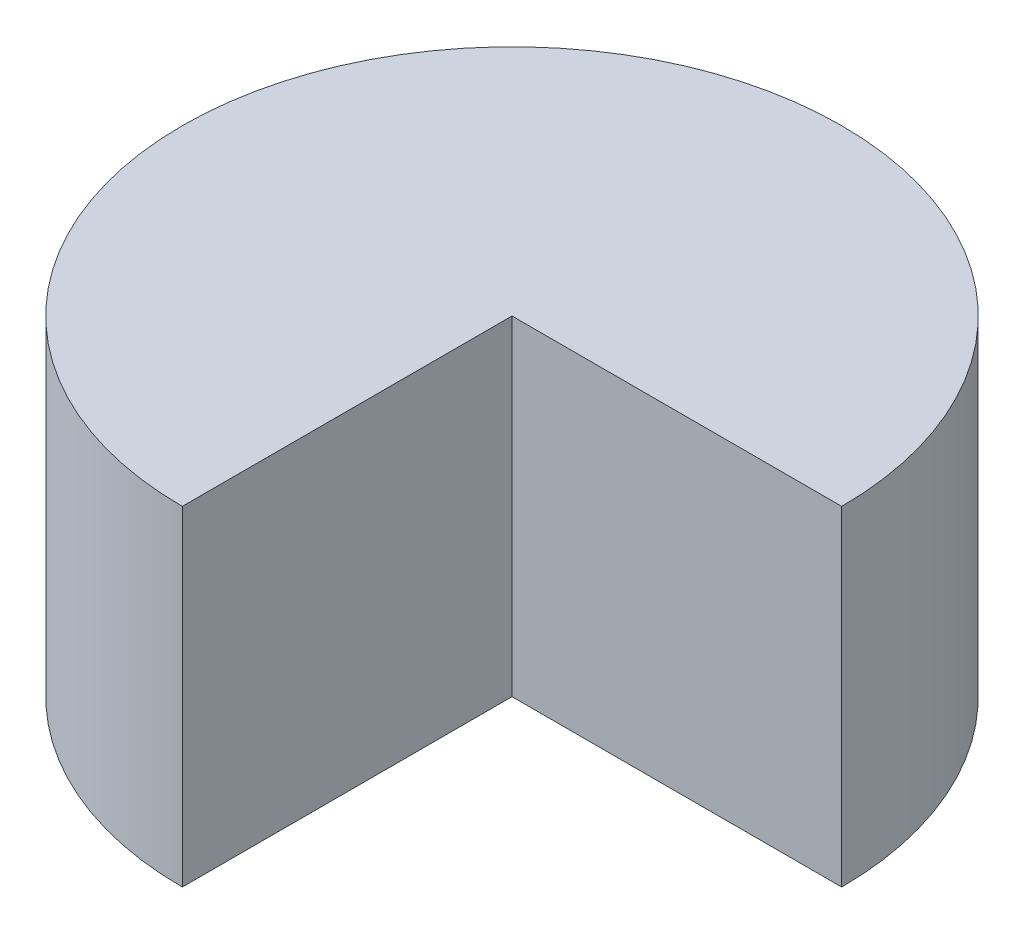
ISO-10303-21;
HEADER;
FILE_DESCRIPTION(('STEP AP214'),'2;1');
FILE_NAME('part.step','',(''),(''),'','','');
FILE_SCHEMA(('AUTOMOTIVE_DESIGN { 1 0 10303 214 1 1 1 1 }'));
ENDSEC;
DATA;
#1=APPLICATION_CONTEXT('core data for automotive mechanical design processes');
#2=APPLICATION_PROTOCOL_DEFINITION('international standard','automotive_design',2000,#1);
#3=PRODUCT_CONTEXT('',#1,'mechanical');
#4=PRODUCT('Part','Part','',(#3));
#5=PRODUCT_RELATED_PRODUCT_CATEGORY('part','',(#4));
#6=PRODUCT_DEFINITION_FORMATION('','',#4);
#7=PRODUCT_DEFINITION_CONTEXT('part definition',#1,'design');
#8=PRODUCT_DEFINITION('design','',#6,#7);
#9=PRODUCT_DEFINITION_SHAPE('','',#8);
#10=(LENGTH_UNIT() NAMED_UNIT(*) SI_UNIT(.MILLI.,.METRE.));
#11=(NAMED_UNIT(*) PLANE_ANGLE_UNIT() SI_UNIT($,.RADIAN.));
#12=(NAMED_UNIT(*) SI_UNIT($,.STERADIAN.) SOLID_ANGLE_UNIT());
#13=UNCERTAINTY_MEASURE_WITH_UNIT(LENGTH_MEASURE(1.E-05),#10,'distance_accuracy_value','');
#14=(GEOMETRIC_REPRESENTATION_CONTEXT(3) GLOBAL_UNCERTAINTY_ASSIGNED_CONTEXT((#13)) GLOBAL_UNIT_ASSIGNED_CONTEXT((#10,
#11,#12)) REPRESENTATION_CONTEXT('',''));
#15=CARTESIAN_POINT('',(0.,0.,0.));
#16=DIRECTION('',(0.,0.,1.));
#17=DIRECTION('',(1.,0.,0.));
#18=AXIS2_PLACEMENT_3D('',#15,#16,#17);
#19=CARTESIAN_POINT('',(0.,0.,0.));
#20=DIRECTION('',(0.,-1.,0.));
#21=DIRECTION('',(0.,0.,-1.));
#22=AXIS2_PLACEMENT_3D('',#19,#20,#21);
#23=PLANE('',#22);
#24=DIRECTION('',(0.,0.,-1.));
#25=VECTOR('',#24,1.);
#26=CARTESIAN_POINT('',(0.,0.,80.));
#27=LINE('',#26,#25);
#28=CARTESIAN_POINT('',(0.,0.,80.));
#29=VERTEX_POINT('',#28);
#30=CARTESIAN_POINT('',(0.,0.,0.));
#31=VERTEX_POINT('',#30);
#32=EDGE_CURVE('E126',#29,#31,#27,.T.);
#33=ORIENTED_EDGE('',*,*,#32,.F.);
#34=CARTESIAN_POINT('',(0.,0.,0.));
#35=DIRECTION('',(0.,1.,0.));
#36=DIRECTION('',(0.,0.,-1.));
#37=AXIS2_PLACEMENT_3D('',#34,#35,#36);
#38=CIRCLE('',#37,80.);
#39=CARTESIAN_POINT('',(80.,0.,0.));
#40=VERTEX_POINT('',#39);
#41=EDGE_CURVE('E81',#40,#29,#38,.T.);
#42=ORIENTED_EDGE('',*,*,#41,.F.);
#43=DIRECTION('',(1.,0.,0.));
#44=VECTOR('',#43,1.);
#45=CARTESIAN_POINT('',(0.,0.,0.));
#46=LINE('',#45,#44);
#47=EDGE_CURVE('E132',#31,#40,#46,.T.);
#48=ORIENTED_EDGE('',*,*,#47,.F.);
#49=EDGE_LOOP('',(#33,#42,#48));
#50=FACE_BOUND('',#49,.T.);
#51=CARTESIAN_POINT('',(0.,0.,0.));
#52=DIRECTION('',(0.,-1.,0.));
#53=DIRECTION('',(0.,0.,-1.));
#54=AXIS2_PLACEMENT_3D('',#51,#52,#53);
#55=CIRCLE('',#54,75.);
#56=CARTESIAN_POINT('',(74.8331477354788,0.,-5.));
#57=VERTEX_POINT('',#56);
#58=CARTESIAN_POINT('',(-5.,0.,74.8331477354788));
#59=VERTEX_POINT('',#58);
#60=EDGE_CURVE('E55',#57,#59,#55,.F.);
#61=ORIENTED_EDGE('',*,*,#60,.T.);
#62=DIRECTION('',(0.,0.,-1.));
#63=VECTOR('',#62,1.);
#64=CARTESIAN_POINT('',(-5.,0.,0.));
#65=LINE('',#64,#63);
#66=CARTESIAN_POINT('',(-5.,0.,-5.));
#67=VERTEX_POINT('',#66);
#68=EDGE_CURVE('E140',#59,#67,#65,.T.);
#69=ORIENTED_EDGE('',*,*,#68,.T.);
#70=DIRECTION('',(1.,0.,0.));
#71=VECTOR('',#70,1.);
#72=CARTESIAN_POINT('',(0.,0.,-5.));
#73=LINE('',#72,#71);
#74=EDGE_CURVE('E124',#67,#57,#73,.T.);
#75=ORIENTED_EDGE('',*,*,#74,.T.);
#76=EDGE_LOOP('',(#61,#69,#75));
#77=FACE_BOUND('',#76,.T.);
#78=ADVANCED_FACE('F39',(#50,#77),#23,.T.);
#79=CARTESIAN_POINT('',(0.,80.,80.));
#80=DIRECTION('',(-1.,0.,0.));
#81=DIRECTION('',(0.,0.,1.));
#82=AXIS2_PLACEMENT_3D('',#79,#80,#81);
#83=PLANE('',#82);
#84=ORIENTED_EDGE('',*,*,#32,.T.);
#85=DIRECTION('',(0.,-1.,0.));
#86=VECTOR('',#85,1.);
#87=CARTESIAN_POINT('',(0.,80.,0.));
#88=LINE('',#87,#86);
#89=CARTESIAN_POINT('',(0.,80.,0.));
#90=VERTEX_POINT('',#89);
#91=EDGE_CURVE('E11',#90,#31,#88,.T.);
#92=ORIENTED_EDGE('',*,*,#91,.F.);
#93=DIRECTION('',(0.,0.,-1.));
#94=VECTOR('',#93,1.);
#95=CARTESIAN_POINT('',(0.,80.,80.));
#96=LINE('',#95,#94);
#97=CARTESIAN_POINT('',(0.,80.,80.));
#98=VERTEX_POINT('',#97);
#99=EDGE_CURVE('E147',#98,#90,#96,.T.);
#100=ORIENTED_EDGE('',*,*,#99,.F.);
#101=DIRECTION('',(0.,-1.,0.));
#102=VECTOR('',#101,1.);
#103=CARTESIAN_POINT('',(0.,80.,80.));
#104=LINE('',#103,#102);
#105=EDGE_CURVE('E153',#98,#29,#104,.T.);
#106=ORIENTED_EDGE('',*,*,#105,.T.);
#107=EDGE_LOOP('',(#84,#92,#100,#106));
#108=FACE_BOUND('',#107,.T.);
#109=ADVANCED_FACE('F41',(#108),#83,.F.);
#110=CARTESIAN_POINT('',(0.,80.,0.));
#111=DIRECTION('',(0.,0.,-1.));
#112=DIRECTION('',(-1.,0.,0.));
#113=AXIS2_PLACEMENT_3D('',#110,#111,#112);
#114=PLANE('',#113);
#115=ORIENTED_EDGE('',*,*,#47,.T.);
#116=DIRECTION('',(0.,-1.,0.));
#117=VECTOR('',#116,1.);
#118=CARTESIAN_POINT('',(80.,80.,0.));
#119=LINE('',#118,#117);
#120=CARTESIAN_POINT('',(80.,80.,0.));
#121=VERTEX_POINT('',#120);
#122=EDGE_CURVE('E48',#121,#40,#119,.T.);
#123=ORIENTED_EDGE('',*,*,#122,.F.);
#124=DIRECTION('',(1.,0.,0.));
#125=VECTOR('',#124,1.);
#126=CARTESIAN_POINT('',(0.,80.,0.));
#127=LINE('',#126,#125);
#128=EDGE_CURVE('E86',#90,#121,#127,.T.);
#129=ORIENTED_EDGE('',*,*,#128,.F.);
#130=ORIENTED_EDGE('',*,*,#91,.T.);
#131=EDGE_LOOP('',(#115,#123,#129,#130));
#132=FACE_BOUND('',#131,.T.);
#133=ADVANCED_FACE('F176',(#132),#114,.F.);
#134=CARTESIAN_POINT('',(0.,80.,0.));
#135=DIRECTION('',(0.,-1.,0.));
#136=DIRECTION('',(0.,0.,-1.));
#137=AXIS2_PLACEMENT_3D('',#134,#135,#136);
#138=CYLINDRICAL_SURFACE('',#137,80.);
#139=ORIENTED_EDGE('',*,*,#41,.T.);
#140=ORIENTED_EDGE('',*,*,#105,.F.);
#141=CARTESIAN_POINT('',(0.,80.,0.));
#142=DIRECTION('',(0.,1.,0.));
#143=DIRECTION('',(0.,0.,-1.));
#144=AXIS2_PLACEMENT_3D('',#141,#142,#143);
#145=CIRCLE('',#144,80.);
#146=EDGE_CURVE('E64',#121,#98,#145,.T.);
#147=ORIENTED_EDGE('',*,*,#146,.F.);
#148=ORIENTED_EDGE('',*,*,#122,.T.);
#149=EDGE_LOOP('',(#139,#140,#147,#148));
#150=FACE_BOUND('',#149,.T.);
#151=ADVANCED_FACE('F161',(#150),#138,.T.);
#152=CARTESIAN_POINT('',(0.,80.,0.));
#153=DIRECTION('',(0.,-1.,0.));
#154=DIRECTION('',(0.,0.,-1.));
#155=AXIS2_PLACEMENT_3D('',#152,#153,#154);
#156=PLANE('',#155);
#157=ORIENTED_EDGE('',*,*,#99,.T.);
#158=ORIENTED_EDGE('',*,*,#128,.T.);
#159=ORIENTED_EDGE('',*,*,#146,.T.);
#160=EDGE_LOOP('',(#157,#158,#159));
#161=FACE_BOUND('',#160,.T.);
#162=ADVANCED_FACE('F168',(#161),#156,.F.);
#163=CARTESIAN_POINT('',(-5.,80.,80.));
#164=DIRECTION('',(-1.,0.,0.));
#165=DIRECTION('',(0.,0.,1.));
#166=AXIS2_PLACEMENT_3D('',#163,#164,#165);
#167=PLANE('',#166);
#168=ORIENTED_EDGE('',*,*,#68,.F.);
#169=DIRECTION('',(0.,-1.,0.));
#170=VECTOR('',#169,1.);
#171=CARTESIAN_POINT('',(-5.,75.,74.8331477354788));
#172=LINE('',#171,#170);
#173=CARTESIAN_POINT('',(-5.,75.,74.8331477354788));
#174=VERTEX_POINT('',#173);
#175=EDGE_CURVE('E119',#174,#59,#172,.T.);
#176=ORIENTED_EDGE('',*,*,#175,.F.);
#177=DIRECTION('',(0.,0.,-1.));
#178=VECTOR('',#177,1.);
#179=CARTESIAN_POINT('',(-5.,75.,0.));
#180=LINE('',#179,#178);
#181=CARTESIAN_POINT('',(-5.,75.,-5.));
#182=VERTEX_POINT('',#181);
#183=EDGE_CURVE('E106',#174,#182,#180,.T.);
#184=ORIENTED_EDGE('',*,*,#183,.T.);
#185=DIRECTION('',(0.,-1.,0.));
#186=VECTOR('',#185,1.);
#187=CARTESIAN_POINT('',(-5.,80.,-5.));
#188=LINE('',#187,#186);
#189=EDGE_CURVE('E117',#182,#67,#188,.T.);
#190=ORIENTED_EDGE('',*,*,#189,.T.);
#191=EDGE_LOOP('',(#168,#176,#184,#190));
#192=FACE_BOUND('',#191,.T.);
#193=ADVANCED_FACE('F116',(#192),#167,.T.);
#194=CARTESIAN_POINT('',(0.,80.,-5.));
#195=DIRECTION('',(0.,0.,-1.));
#196=DIRECTION('',(-1.,0.,0.));
#197=AXIS2_PLACEMENT_3D('',#194,#195,#196);
#198=PLANE('',#197);
#199=ORIENTED_EDGE('',*,*,#74,.F.);
#200=ORIENTED_EDGE('',*,*,#189,.F.);
#201=DIRECTION('',(1.,0.,0.));
#202=VECTOR('',#201,1.);
#203=CARTESIAN_POINT('',(0.,75.,-5.));
#204=LINE('',#203,#202);
#205=CARTESIAN_POINT('',(74.8331477354788,75.,-5.));
#206=VERTEX_POINT('',#205);
#207=EDGE_CURVE('E103',#182,#206,#204,.T.);
#208=ORIENTED_EDGE('',*,*,#207,.T.);
#209=DIRECTION('',(0.,-1.,0.));
#210=VECTOR('',#209,1.);
#211=CARTESIAN_POINT('',(74.8331477354788,75.,-5.));
#212=LINE('',#211,#210);
#213=EDGE_CURVE('E127',#206,#57,#212,.T.);
#214=ORIENTED_EDGE('',*,*,#213,.T.);
#215=EDGE_LOOP('',(#199,#200,#208,#214));
#216=FACE_BOUND('',#215,.T.);
#217=ADVANCED_FACE('F122',(#216),#198,.T.);
#218=CARTESIAN_POINT('',(0.,80.,0.));
#219=DIRECTION('',(0.,-1.,0.));
#220=DIRECTION('',(0.,0.,-1.));
#221=AXIS2_PLACEMENT_3D('',#218,#219,#220);
#222=CYLINDRICAL_SURFACE('',#221,75.);
#223=ORIENTED_EDGE('',*,*,#60,.F.);
#224=ORIENTED_EDGE('',*,*,#213,.F.);
#225=CARTESIAN_POINT('',(0.,75.,0.));
#226=DIRECTION('',(0.,-1.,0.));
#227=DIRECTION('',(0.,0.,-1.));
#228=AXIS2_PLACEMENT_3D('',#225,#226,#227);
#229=CIRCLE('',#228,75.);
#230=EDGE_CURVE('E107',#206,#174,#229,.F.);
#231=ORIENTED_EDGE('',*,*,#230,.T.);
#232=ORIENTED_EDGE('',*,*,#175,.T.);
#233=EDGE_LOOP('',(#223,#224,#231,#232));
#234=FACE_BOUND('',#233,.T.);
#235=ADVANCED_FACE('F216',(#234),#222,.F.);
#236=CARTESIAN_POINT('',(0.,75.,0.));
#237=DIRECTION('',(0.,-1.,0.));
#238=DIRECTION('',(0.,0.,-1.));
#239=AXIS2_PLACEMENT_3D('',#236,#237,#238);
#240=PLANE('',#239);
#241=ORIENTED_EDGE('',*,*,#183,.F.);
#242=ORIENTED_EDGE('',*,*,#230,.F.);
#243=ORIENTED_EDGE('',*,*,#207,.F.);
#244=EDGE_LOOP('',(#241,#242,#243));
#245=FACE_BOUND('',#244,.T.);
#246=ADVANCED_FACE('F105',(#245),#240,.T.);
#247=CLOSED_SHELL('',(#78,#109,#133,#151,#162,#193,#217,#235,#246));
#248=MANIFOLD_SOLID_BREP('B2',#247);
#249=ADVANCED_BREP_SHAPE_REPRESENTATION('',(#18,#248),#14);
#250=SHAPE_DEFINITION_REPRESENTATION(#9,#249);
ENDSEC;
END-ISO-10303-21;
